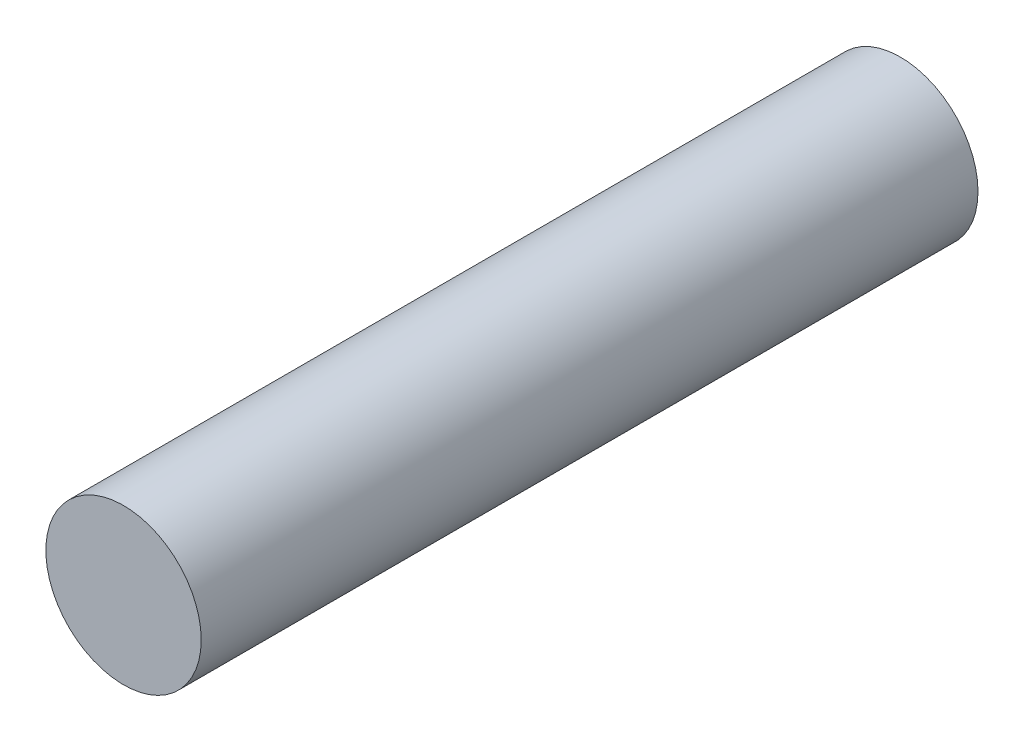
ISO-10303-21;
HEADER;
FILE_DESCRIPTION(('STEP AP214'),'2;1');
FILE_NAME('part.step','',(''),(''),'','','');
FILE_SCHEMA(('AUTOMOTIVE_DESIGN { 1 0 10303 214 1 1 1 1 }'));
ENDSEC;
DATA;
#1=APPLICATION_CONTEXT('core data for automotive mechanical design processes');
#2=APPLICATION_PROTOCOL_DEFINITION('international standard','automotive_design',2000,#1);
#3=PRODUCT_CONTEXT('',#1,'mechanical');
#4=PRODUCT('Part','Part','',(#3));
#5=PRODUCT_RELATED_PRODUCT_CATEGORY('part','',(#4));
#6=PRODUCT_DEFINITION_FORMATION('','',#4);
#7=PRODUCT_DEFINITION_CONTEXT('part definition',#1,'design');
#8=PRODUCT_DEFINITION('design','',#6,#7);
#9=PRODUCT_DEFINITION_SHAPE('','',#8);
#10=(LENGTH_UNIT() NAMED_UNIT(*) SI_UNIT(.MILLI.,.METRE.));
#11=(NAMED_UNIT(*) PLANE_ANGLE_UNIT() SI_UNIT($,.RADIAN.));
#12=(NAMED_UNIT(*) SI_UNIT($,.STERADIAN.) SOLID_ANGLE_UNIT());
#13=UNCERTAINTY_MEASURE_WITH_UNIT(LENGTH_MEASURE(1.E-05),#10,'distance_accuracy_value','');
#14=(GEOMETRIC_REPRESENTATION_CONTEXT(3) GLOBAL_UNCERTAINTY_ASSIGNED_CONTEXT((#13)) GLOBAL_UNIT_ASSIGNED_CONTEXT((#10,
#11,#12)) REPRESENTATION_CONTEXT('',''));
#15=CARTESIAN_POINT('',(0.,0.,0.));
#16=DIRECTION('',(0.,0.,1.));
#17=DIRECTION('',(1.,0.,0.));
#18=AXIS2_PLACEMENT_3D('',#15,#16,#17);
#19=CARTESIAN_POINT('',(0.,0.,12.7));
#20=DIRECTION('',(0.,0.,-1.));
#21=DIRECTION('',(-1.,0.,0.));
#22=AXIS2_PLACEMENT_3D('',#19,#20,#21);
#23=CYLINDRICAL_SURFACE('',#22,1.27);
#24=CARTESIAN_POINT('',(0.,0.,12.7));
#25=DIRECTION('',(0.,0.,1.));
#26=DIRECTION('',(1.,0.,0.));
#27=AXIS2_PLACEMENT_3D('',#24,#25,#26);
#28=CIRCLE('',#27,1.27);
#29=CARTESIAN_POINT('',(1.27,0.,12.7));
#30=VERTEX_POINT('',#29);
#31=EDGE_CURVE('E10',#30,#30,#28,.T.);
#32=ORIENTED_EDGE('',*,*,#31,.F.);
#33=EDGE_LOOP('',(#32));
#34=FACE_BOUND('',#33,.T.);
#35=CARTESIAN_POINT('',(0.,0.,0.));
#36=DIRECTION('',(0.,0.,1.));
#37=DIRECTION('',(1.,0.,0.));
#38=AXIS2_PLACEMENT_3D('',#35,#36,#37);
#39=CIRCLE('',#38,1.27);
#40=CARTESIAN_POINT('',(1.27,0.,0.));
#41=VERTEX_POINT('',#40);
#42=EDGE_CURVE('E40',#41,#41,#39,.T.);
#43=ORIENTED_EDGE('',*,*,#42,.T.);
#44=EDGE_LOOP('',(#43));
#45=FACE_BOUND('',#44,.T.);
#46=ADVANCED_FACE('F37',(#34,#45),#23,.T.);
#47=CARTESIAN_POINT('',(0.,0.,12.7));
#48=DIRECTION('',(0.,0.,1.));
#49=DIRECTION('',(1.,0.,0.));
#50=AXIS2_PLACEMENT_3D('',#47,#48,#49);
#51=PLANE('',#50);
#52=ORIENTED_EDGE('',*,*,#31,.T.);
#53=EDGE_LOOP('',(#52));
#54=FACE_BOUND('',#53,.T.);
#55=ADVANCED_FACE('F54',(#54),#51,.T.);
#56=CARTESIAN_POINT('',(0.,0.,0.));
#57=DIRECTION('',(0.,0.,1.));
#58=DIRECTION('',(1.,0.,0.));
#59=AXIS2_PLACEMENT_3D('',#56,#57,#58);
#60=PLANE('',#59);
#61=ORIENTED_EDGE('',*,*,#42,.F.);
#62=EDGE_LOOP('',(#61));
#63=FACE_BOUND('',#62,.T.);
#64=ADVANCED_FACE('F52',(#63),#60,.F.);
#65=CLOSED_SHELL('',(#46,#55,#64));
#66=MANIFOLD_SOLID_BREP('B2',#65);
#67=ADVANCED_BREP_SHAPE_REPRESENTATION('',(#18,#66),#14);
#68=SHAPE_DEFINITION_REPRESENTATION(#9,#67);
ENDSEC;
END-ISO-10303-21;
